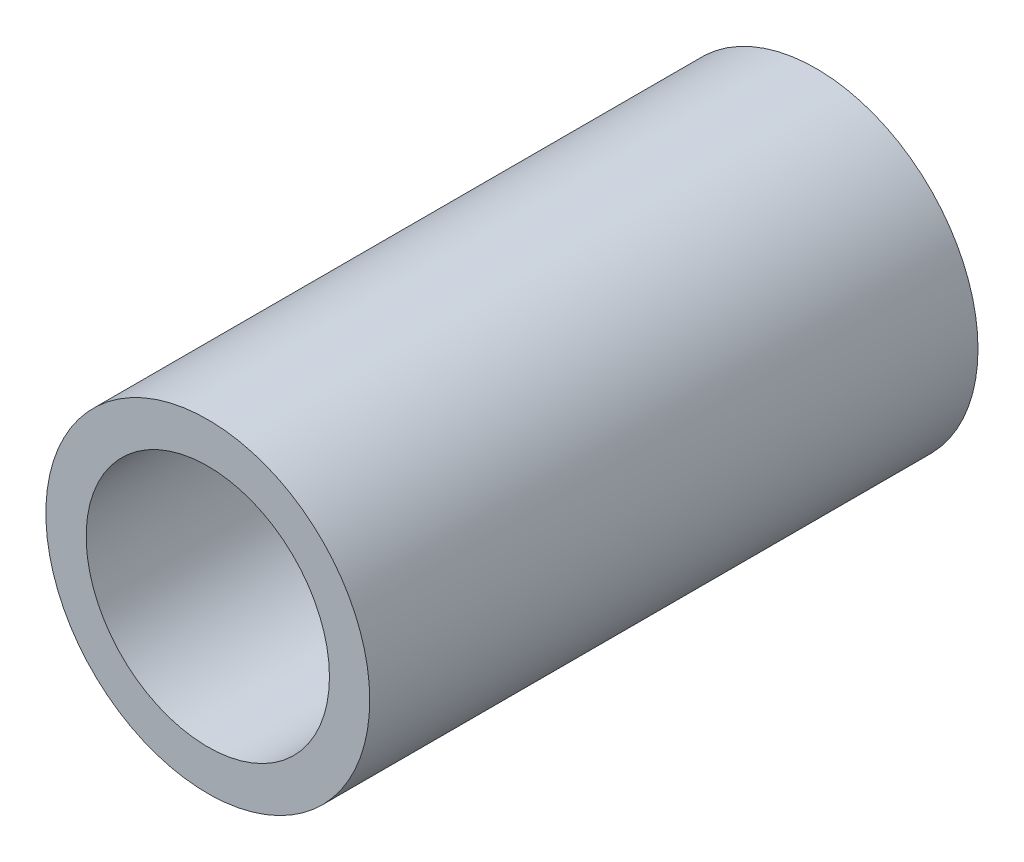
ISO-10303-21;
HEADER;
FILE_DESCRIPTION(('STEP AP214'),'2;1');
FILE_NAME('part.step','',(''),(''),'','','');
FILE_SCHEMA(('AUTOMOTIVE_DESIGN { 1 0 10303 214 1 1 1 1 }'));
ENDSEC;
DATA;
#1=APPLICATION_CONTEXT('core data for automotive mechanical design processes');
#2=APPLICATION_PROTOCOL_DEFINITION('international standard','automotive_design',2000,#1);
#3=PRODUCT_CONTEXT('',#1,'mechanical');
#4=PRODUCT('Part','Part','',(#3));
#5=PRODUCT_RELATED_PRODUCT_CATEGORY('part','',(#4));
#6=PRODUCT_DEFINITION_FORMATION('','',#4);
#7=PRODUCT_DEFINITION_CONTEXT('part definition',#1,'design');
#8=PRODUCT_DEFINITION('design','',#6,#7);
#9=PRODUCT_DEFINITION_SHAPE('','',#8);
#10=(LENGTH_UNIT() NAMED_UNIT(*) SI_UNIT(.MILLI.,.METRE.));
#11=(NAMED_UNIT(*) PLANE_ANGLE_UNIT() SI_UNIT($,.RADIAN.));
#12=(NAMED_UNIT(*) SI_UNIT($,.STERADIAN.) SOLID_ANGLE_UNIT());
#13=UNCERTAINTY_MEASURE_WITH_UNIT(LENGTH_MEASURE(1.E-05),#10,'distance_accuracy_value','');
#14=(GEOMETRIC_REPRESENTATION_CONTEXT(3) GLOBAL_UNCERTAINTY_ASSIGNED_CONTEXT((#13)) GLOBAL_UNIT_ASSIGNED_CONTEXT((#10,
#11,#12)) REPRESENTATION_CONTEXT('',''));
#15=CARTESIAN_POINT('',(0.,0.,0.));
#16=DIRECTION('',(0.,0.,1.));
#17=DIRECTION('',(1.,0.,0.));
#18=AXIS2_PLACEMENT_3D('',#15,#16,#17);
#19=CARTESIAN_POINT('',(0.,0.,40.));
#20=DIRECTION('',(0.,0.,1.));
#21=DIRECTION('',(1.,0.,0.));
#22=AXIS2_PLACEMENT_3D('',#19,#20,#21);
#23=PLANE('',#22);
#24=CARTESIAN_POINT('',(0.,0.,40.));
#25=DIRECTION('',(0.,0.,1.));
#26=DIRECTION('',(1.,0.,0.));
#27=AXIS2_PLACEMENT_3D('',#24,#25,#26);
#28=CIRCLE('',#27,10.65);
#29=CARTESIAN_POINT('',(10.65,0.,40.));
#30=VERTEX_POINT('',#29);
#31=EDGE_CURVE('E10',#30,#30,#28,.T.);
#32=ORIENTED_EDGE('',*,*,#31,.T.);
#33=EDGE_LOOP('',(#32));
#34=FACE_BOUND('',#33,.T.);
#35=CARTESIAN_POINT('',(0.,0.,40.));
#36=DIRECTION('',(0.,0.,1.));
#37=DIRECTION('',(1.,0.,0.));
#38=AXIS2_PLACEMENT_3D('',#35,#36,#37);
#39=CIRCLE('',#38,8.);
#40=CARTESIAN_POINT('',(8.,0.,40.));
#41=VERTEX_POINT('',#40);
#42=EDGE_CURVE('E45',#41,#41,#39,.T.);
#43=ORIENTED_EDGE('',*,*,#42,.F.);
#44=EDGE_LOOP('',(#43));
#45=FACE_BOUND('',#44,.T.);
#46=ADVANCED_FACE('F34',(#34,#45),#23,.T.);
#47=CARTESIAN_POINT('',(0.,0.,0.));
#48=DIRECTION('',(0.,0.,1.));
#49=DIRECTION('',(1.,0.,0.));
#50=AXIS2_PLACEMENT_3D('',#47,#48,#49);
#51=PLANE('',#50);
#52=CARTESIAN_POINT('',(0.,0.,0.));
#53=DIRECTION('',(0.,0.,1.));
#54=DIRECTION('',(1.,0.,0.));
#55=AXIS2_PLACEMENT_3D('',#52,#53,#54);
#56=CIRCLE('',#55,10.65);
#57=CARTESIAN_POINT('',(10.65,0.,0.));
#58=VERTEX_POINT('',#57);
#59=EDGE_CURVE('E38',#58,#58,#56,.T.);
#60=ORIENTED_EDGE('',*,*,#59,.F.);
#61=EDGE_LOOP('',(#60));
#62=FACE_BOUND('',#61,.T.);
#63=CARTESIAN_POINT('',(0.,0.,0.));
#64=DIRECTION('',(0.,0.,1.));
#65=DIRECTION('',(1.,0.,0.));
#66=AXIS2_PLACEMENT_3D('',#63,#64,#65);
#67=CIRCLE('',#66,8.);
#68=CARTESIAN_POINT('',(8.,0.,0.));
#69=VERTEX_POINT('',#68);
#70=EDGE_CURVE('E47',#69,#69,#67,.T.);
#71=ORIENTED_EDGE('',*,*,#70,.T.);
#72=EDGE_LOOP('',(#71));
#73=FACE_BOUND('',#72,.T.);
#74=ADVANCED_FACE('F57',(#62,#73),#51,.F.);
#75=CARTESIAN_POINT('',(0.,0.,40.));
#76=DIRECTION('',(0.,0.,-1.));
#77=DIRECTION('',(-1.,0.,0.));
#78=AXIS2_PLACEMENT_3D('',#75,#76,#77);
#79=CYLINDRICAL_SURFACE('',#78,10.65);
#80=ORIENTED_EDGE('',*,*,#31,.F.);
#81=EDGE_LOOP('',(#80));
#82=FACE_BOUND('',#81,.T.);
#83=ORIENTED_EDGE('',*,*,#59,.T.);
#84=EDGE_LOOP('',(#83));
#85=FACE_BOUND('',#84,.T.);
#86=ADVANCED_FACE('F36',(#82,#85),#79,.T.);
#87=CARTESIAN_POINT('',(0.,0.,40.));
#88=DIRECTION('',(0.,0.,-1.));
#89=DIRECTION('',(-1.,0.,0.));
#90=AXIS2_PLACEMENT_3D('',#87,#88,#89);
#91=CYLINDRICAL_SURFACE('',#90,8.);
#92=ORIENTED_EDGE('',*,*,#42,.T.);
#93=EDGE_LOOP('',(#92));
#94=FACE_BOUND('',#93,.T.);
#95=ORIENTED_EDGE('',*,*,#70,.F.);
#96=EDGE_LOOP('',(#95));
#97=FACE_BOUND('',#96,.T.);
#98=ADVANCED_FACE('F53',(#94,#97),#91,.F.);
#99=CLOSED_SHELL('',(#46,#74,#86,#98));
#100=MANIFOLD_SOLID_BREP('B2',#99);
#101=ADVANCED_BREP_SHAPE_REPRESENTATION('',(#18,#100),#14);
#102=SHAPE_DEFINITION_REPRESENTATION(#9,#101);
ENDSEC;
END-ISO-10303-21;
